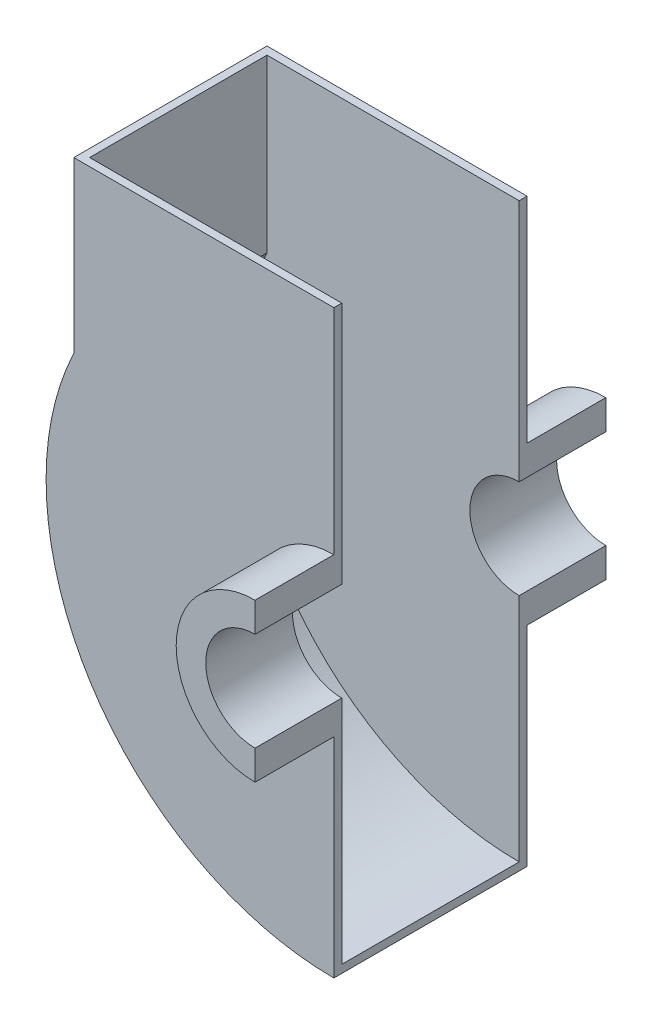
ISO-10303-21;
HEADER;
FILE_DESCRIPTION(('STEP AP214'),'2;1');
FILE_NAME('part.step','',(''),(''),'','','');
FILE_SCHEMA(('AUTOMOTIVE_DESIGN { 1 0 10303 214 1 1 1 1 }'));
ENDSEC;
DATA;
#1=APPLICATION_CONTEXT('core data for automotive mechanical design processes');
#2=APPLICATION_PROTOCOL_DEFINITION('international standard','automotive_design',2000,#1);
#3=PRODUCT_CONTEXT('',#1,'mechanical');
#4=PRODUCT('Part','Part','',(#3));
#5=PRODUCT_RELATED_PRODUCT_CATEGORY('part','',(#4));
#6=PRODUCT_DEFINITION_FORMATION('','',#4);
#7=PRODUCT_DEFINITION_CONTEXT('part definition',#1,'design');
#8=PRODUCT_DEFINITION('design','',#6,#7);
#9=PRODUCT_DEFINITION_SHAPE('','',#8);
#10=(LENGTH_UNIT() NAMED_UNIT(*) SI_UNIT(.MILLI.,.METRE.));
#11=(NAMED_UNIT(*) PLANE_ANGLE_UNIT() SI_UNIT($,.RADIAN.));
#12=(NAMED_UNIT(*) SI_UNIT($,.STERADIAN.) SOLID_ANGLE_UNIT());
#13=UNCERTAINTY_MEASURE_WITH_UNIT(LENGTH_MEASURE(1.E-05),#10,'distance_accuracy_value','');
#14=(GEOMETRIC_REPRESENTATION_CONTEXT(3) GLOBAL_UNCERTAINTY_ASSIGNED_CONTEXT((#13)) GLOBAL_UNIT_ASSIGNED_CONTEXT((#10,
#11,#12)) REPRESENTATION_CONTEXT('',''));
#15=CARTESIAN_POINT('',(0.,0.,0.));
#16=DIRECTION('',(0.,0.,1.));
#17=DIRECTION('',(1.,0.,0.));
#18=AXIS2_PLACEMENT_3D('',#15,#16,#17);
#19=CARTESIAN_POINT('',(65.97,-86.7563449558645,24.5));
#20=DIRECTION('',(-1.,0.,0.));
#21=DIRECTION('',(0.,0.,1.));
#22=AXIS2_PLACEMENT_3D('',#19,#20,#21);
#23=PLANE('',#22);
#24=DIRECTION('',(0.,1.,0.));
#25=VECTOR('',#24,1.);
#26=CARTESIAN_POINT('',(65.97,-74.2563449558645,-22.5));
#27=LINE('',#26,#25);
#28=CARTESIAN_POINT('',(65.97,-145.256344955865,-22.5));
#29=VERTEX_POINT('',#28);
#30=CARTESIAN_POINT('',(65.97,-86.7563449558645,-22.5));
#31=VERTEX_POINT('',#30);
#32=EDGE_CURVE('E210',#29,#31,#27,.T.);
#33=ORIENTED_EDGE('',*,*,#32,.F.);
#34=DIRECTION('',(0.,0.,-1.));
#35=VECTOR('',#34,1.);
#36=CARTESIAN_POINT('',(65.97,-145.256344955865,22.5));
#37=LINE('',#36,#35);
#38=CARTESIAN_POINT('',(65.97,-145.256344955865,22.5));
#39=VERTEX_POINT('',#38);
#40=EDGE_CURVE('E203',#39,#29,#37,.T.);
#41=ORIENTED_EDGE('',*,*,#40,.F.);
#42=DIRECTION('',(0.,1.,0.));
#43=VECTOR('',#42,1.);
#44=CARTESIAN_POINT('',(65.97,-74.2563449558645,22.5));
#45=LINE('',#44,#43);
#46=CARTESIAN_POINT('',(65.97,-86.7563449558645,22.5));
#47=VERTEX_POINT('',#46);
#48=EDGE_CURVE('E212',#39,#47,#45,.T.);
#49=ORIENTED_EDGE('',*,*,#48,.T.);
#50=DIRECTION('',(0.,0.,-1.));
#51=VECTOR('',#50,1.);
#52=CARTESIAN_POINT('',(65.97,-86.7563449558645,24.5));
#53=LINE('',#52,#51);
#54=CARTESIAN_POINT('',(65.97,-86.7563449558645,44.5));
#55=VERTEX_POINT('',#54);
#56=EDGE_CURVE('E268',#55,#47,#53,.T.);
#57=ORIENTED_EDGE('',*,*,#56,.F.);
#58=DIRECTION('',(0.,1.,0.));
#59=VECTOR('',#58,1.);
#60=CARTESIAN_POINT('',(65.97,-86.7563449558645,44.5));
#61=LINE('',#60,#59);
#62=CARTESIAN_POINT('',(65.97,-94.2563449558645,44.5));
#63=VERTEX_POINT('',#62);
#64=EDGE_CURVE('E180',#63,#55,#61,.T.);
#65=ORIENTED_EDGE('',*,*,#64,.F.);
#66=DIRECTION('',(0.,0.,-1.));
#67=VECTOR('',#66,1.);
#68=CARTESIAN_POINT('',(65.97,-94.2563449558645,44.5));
#69=LINE('',#68,#67);
#70=CARTESIAN_POINT('',(65.97,-94.2563449558645,24.5));
#71=VERTEX_POINT('',#70);
#72=EDGE_CURVE('E192',#63,#71,#69,.T.);
#73=ORIENTED_EDGE('',*,*,#72,.T.);
#74=DIRECTION('',(0.,1.,0.));
#75=VECTOR('',#74,1.);
#76=CARTESIAN_POINT('',(65.97,-86.7563449558645,24.5));
#77=LINE('',#76,#75);
#78=CARTESIAN_POINT('',(65.97,-147.256344955864,24.5));
#79=VERTEX_POINT('',#78);
#80=EDGE_CURVE('E241',#79,#71,#77,.T.);
#81=ORIENTED_EDGE('',*,*,#80,.F.);
#82=DIRECTION('',(0.,0.,-1.));
#83=VECTOR('',#82,1.);
#84=CARTESIAN_POINT('',(65.97,-147.256344955864,24.5));
#85=LINE('',#84,#83);
#86=CARTESIAN_POINT('',(65.97,-147.256344955864,-24.5));
#87=VERTEX_POINT('',#86);
#88=EDGE_CURVE('E44',#79,#87,#85,.T.);
#89=ORIENTED_EDGE('',*,*,#88,.T.);
#90=DIRECTION('',(0.,1.,0.));
#91=VECTOR('',#90,1.);
#92=CARTESIAN_POINT('',(65.97,-86.7563449558645,-24.5));
#93=LINE('',#92,#91);
#94=CARTESIAN_POINT('',(65.97,-94.2563449558645,-24.5));
#95=VERTEX_POINT('',#94);
#96=EDGE_CURVE('E252',#87,#95,#93,.T.);
#97=ORIENTED_EDGE('',*,*,#96,.T.);
#98=DIRECTION('',(0.,0.,1.));
#99=VECTOR('',#98,1.);
#100=CARTESIAN_POINT('',(65.97,-94.2563449558645,-44.5));
#101=LINE('',#100,#99);
#102=CARTESIAN_POINT('',(65.97,-94.2563449558645,-44.5));
#103=VERTEX_POINT('',#102);
#104=EDGE_CURVE('E51',#103,#95,#101,.T.);
#105=ORIENTED_EDGE('',*,*,#104,.F.);
#106=DIRECTION('',(0.,1.,0.));
#107=VECTOR('',#106,1.);
#108=CARTESIAN_POINT('',(65.97,-86.7563449558645,-44.5));
#109=LINE('',#108,#107);
#110=CARTESIAN_POINT('',(65.97,-86.7563449558645,-44.5));
#111=VERTEX_POINT('',#110);
#112=EDGE_CURVE('E164',#103,#111,#109,.T.);
#113=ORIENTED_EDGE('',*,*,#112,.T.);
#114=EDGE_CURVE('E267',#31,#111,#53,.T.);
#115=ORIENTED_EDGE('',*,*,#114,.F.);
#116=EDGE_LOOP('',(#33,#41,#49,#57,#65,#73,#81,#89,#97,#105,#113,#115));
#117=FACE_BOUND('',#116,.T.);
#118=ADVANCED_FACE('F36',(#117),#23,.F.);
#119=CARTESIAN_POINT('',(65.97,-74.2563449558645,24.5));
#120=DIRECTION('',(0.,0.,-1.));
#121=DIRECTION('',(-1.,0.,0.));
#122=AXIS2_PLACEMENT_3D('',#119,#120,#121);
#123=CYLINDRICAL_SURFACE('',#122,12.5);
#124=CARTESIAN_POINT('',(65.97,-74.2563449558645,-22.5));
#125=DIRECTION('',(0.,0.,-1.));
#126=DIRECTION('',(-1.,0.,0.));
#127=AXIS2_PLACEMENT_3D('',#124,#125,#126);
#128=CIRCLE('',#127,12.5);
#129=CARTESIAN_POINT('',(65.97,-61.7563449558645,-22.5));
#130=VERTEX_POINT('',#129);
#131=EDGE_CURVE('E230',#31,#130,#128,.T.);
#132=ORIENTED_EDGE('',*,*,#131,.F.);
#133=ORIENTED_EDGE('',*,*,#114,.T.);
#134=CARTESIAN_POINT('',(65.97,-74.2563449558645,-44.5));
#135=DIRECTION('',(0.,0.,-1.));
#136=DIRECTION('',(1.,0.,0.));
#137=AXIS2_PLACEMENT_3D('',#134,#135,#136);
#138=CIRCLE('',#137,12.5);
#139=CARTESIAN_POINT('',(65.97,-61.7563449558645,-44.5));
#140=VERTEX_POINT('',#139);
#141=EDGE_CURVE('E170',#111,#140,#138,.T.);
#142=ORIENTED_EDGE('',*,*,#141,.T.);
#143=DIRECTION('',(0.,0.,-1.));
#144=VECTOR('',#143,1.);
#145=CARTESIAN_POINT('',(65.97,-61.7563449558645,24.5));
#146=LINE('',#145,#144);
#147=EDGE_CURVE('E169',#130,#140,#146,.T.);
#148=ORIENTED_EDGE('',*,*,#147,.F.);
#149=EDGE_LOOP('',(#132,#133,#142,#148));
#150=FACE_BOUND('',#149,.T.);
#151=ADVANCED_FACE('F301',(#150),#123,.F.);
#152=CARTESIAN_POINT('',(65.97,0.,24.5));
#153=DIRECTION('',(-1.,0.,0.));
#154=DIRECTION('',(0.,-1.,0.));
#155=AXIS2_PLACEMENT_3D('',#152,#153,#154);
#156=PLANE('',#155);
#157=DIRECTION('',(0.,1.,0.));
#158=VECTOR('',#157,1.);
#159=CARTESIAN_POINT('',(65.97,-74.2563449558645,-22.5));
#160=LINE('',#159,#158);
#161=CARTESIAN_POINT('',(65.97,0.,-22.5));
#162=VERTEX_POINT('',#161);
#163=EDGE_CURVE('E232',#130,#162,#160,.T.);
#164=ORIENTED_EDGE('',*,*,#163,.F.);
#165=ORIENTED_EDGE('',*,*,#147,.T.);
#166=DIRECTION('',(0.,1.,0.));
#167=VECTOR('',#166,1.);
#168=CARTESIAN_POINT('',(65.97,-54.2563449558645,-44.5));
#169=LINE('',#168,#167);
#170=CARTESIAN_POINT('',(65.97,-54.2563449558645,-44.5));
#171=VERTEX_POINT('',#170);
#172=EDGE_CURVE('E161',#140,#171,#169,.T.);
#173=ORIENTED_EDGE('',*,*,#172,.T.);
#174=DIRECTION('',(0.,0.,1.));
#175=VECTOR('',#174,1.);
#176=CARTESIAN_POINT('',(65.97,-54.2563449558645,-44.5));
#177=LINE('',#176,#175);
#178=CARTESIAN_POINT('',(65.97,-54.2563449558645,-24.5));
#179=VERTEX_POINT('',#178);
#180=EDGE_CURVE('E147',#171,#179,#177,.T.);
#181=ORIENTED_EDGE('',*,*,#180,.T.);
#182=DIRECTION('',(0.,1.,0.));
#183=VECTOR('',#182,1.);
#184=CARTESIAN_POINT('',(65.97,0.,-24.5));
#185=LINE('',#184,#183);
#186=CARTESIAN_POINT('',(65.97,0.,-24.5));
#187=VERTEX_POINT('',#186);
#188=EDGE_CURVE('E255',#179,#187,#185,.T.);
#189=ORIENTED_EDGE('',*,*,#188,.T.);
#190=DIRECTION('',(0.,0.,-1.));
#191=VECTOR('',#190,1.);
#192=CARTESIAN_POINT('',(65.97,0.,24.5));
#193=LINE('',#192,#191);
#194=EDGE_CURVE('E260',#162,#187,#193,.T.);
#195=ORIENTED_EDGE('',*,*,#194,.F.);
#196=EDGE_LOOP('',(#164,#165,#173,#181,#189,#195));
#197=FACE_BOUND('',#196,.T.);
#198=ADVANCED_FACE('F167',(#197),#156,.F.);
#199=CARTESIAN_POINT('',(0.,0.,24.5));
#200=DIRECTION('',(0.,-1.,0.));
#201=DIRECTION('',(0.,0.,-1.));
#202=AXIS2_PLACEMENT_3D('',#199,#200,#201);
#203=PLANE('',#202);
#204=DIRECTION('',(-1.,0.,0.));
#205=VECTOR('',#204,1.);
#206=CARTESIAN_POINT('',(65.97,0.,-22.5));
#207=LINE('',#206,#205);
#208=CARTESIAN_POINT('',(2.,0.,-22.5));
#209=VERTEX_POINT('',#208);
#210=EDGE_CURVE('E208',#162,#209,#207,.T.);
#211=ORIENTED_EDGE('',*,*,#210,.F.);
#212=ORIENTED_EDGE('',*,*,#194,.T.);
#213=DIRECTION('',(-1.,0.,0.));
#214=VECTOR('',#213,1.);
#215=CARTESIAN_POINT('',(0.,0.,-24.5));
#216=LINE('',#215,#214);
#217=CARTESIAN_POINT('',(0.,0.,-24.5));
#218=VERTEX_POINT('',#217);
#219=EDGE_CURVE('E239',#187,#218,#216,.T.);
#220=ORIENTED_EDGE('',*,*,#219,.T.);
#221=DIRECTION('',(0.,0.,-1.));
#222=VECTOR('',#221,1.);
#223=CARTESIAN_POINT('',(0.,0.,24.5));
#224=LINE('',#223,#222);
#225=CARTESIAN_POINT('',(0.,0.,24.5));
#226=VERTEX_POINT('',#225);
#227=EDGE_CURVE('E247',#226,#218,#224,.T.);
#228=ORIENTED_EDGE('',*,*,#227,.F.);
#229=DIRECTION('',(-1.,0.,0.));
#230=VECTOR('',#229,1.);
#231=CARTESIAN_POINT('',(0.,0.,24.5));
#232=LINE('',#231,#230);
#233=CARTESIAN_POINT('',(65.97,0.,24.5));
#234=VERTEX_POINT('',#233);
#235=EDGE_CURVE('E245',#234,#226,#232,.T.);
#236=ORIENTED_EDGE('',*,*,#235,.F.);
#237=CARTESIAN_POINT('',(65.97,0.,22.5));
#238=VERTEX_POINT('',#237);
#239=EDGE_CURVE('E261',#234,#238,#193,.T.);
#240=ORIENTED_EDGE('',*,*,#239,.T.);
#241=DIRECTION('',(-1.,0.,0.));
#242=VECTOR('',#241,1.);
#243=CARTESIAN_POINT('',(65.97,0.,22.5));
#244=LINE('',#243,#242);
#245=CARTESIAN_POINT('',(2.,0.,22.5));
#246=VERTEX_POINT('',#245);
#247=EDGE_CURVE('E216',#238,#246,#244,.T.);
#248=ORIENTED_EDGE('',*,*,#247,.T.);
#249=DIRECTION('',(0.,0.,-1.));
#250=VECTOR('',#249,1.);
#251=CARTESIAN_POINT('',(2.,0.,24.5));
#252=LINE('',#251,#250);
#253=EDGE_CURVE('E213',#246,#209,#252,.T.);
#254=ORIENTED_EDGE('',*,*,#253,.T.);
#255=EDGE_LOOP('',(#211,#212,#220,#228,#236,#240,#248,#254));
#256=FACE_BOUND('',#255,.T.);
#257=ADVANCED_FACE('F285',(#256),#203,.F.);
#258=CARTESIAN_POINT('',(0.,0.,24.5));
#259=DIRECTION('',(1.,0.,0.));
#260=DIRECTION('',(0.,1.,0.));
#261=AXIS2_PLACEMENT_3D('',#258,#259,#260);
#262=PLANE('',#261);
#263=DIRECTION('',(0.,-1.,0.));
#264=VECTOR('',#263,1.);
#265=CARTESIAN_POINT('',(0.,0.,-24.5));
#266=LINE('',#265,#264);
#267=CARTESIAN_POINT('',(0.,-43.,-24.5));
#268=VERTEX_POINT('',#267);
#269=EDGE_CURVE('E202',#218,#268,#266,.T.);
#270=ORIENTED_EDGE('',*,*,#269,.T.);
#271=DIRECTION('',(0.,0.,-1.));
#272=VECTOR('',#271,1.);
#273=CARTESIAN_POINT('',(0.,-43.,24.5));
#274=LINE('',#273,#272);
#275=CARTESIAN_POINT('',(0.,-43.,24.5));
#276=VERTEX_POINT('',#275);
#277=EDGE_CURVE('E11',#276,#268,#274,.T.);
#278=ORIENTED_EDGE('',*,*,#277,.F.);
#279=DIRECTION('',(0.,-1.,0.));
#280=VECTOR('',#279,1.);
#281=CARTESIAN_POINT('',(0.,0.,24.5));
#282=LINE('',#281,#280);
#283=EDGE_CURVE('E235',#226,#276,#282,.T.);
#284=ORIENTED_EDGE('',*,*,#283,.F.);
#285=ORIENTED_EDGE('',*,*,#227,.T.);
#286=EDGE_LOOP('',(#270,#278,#284,#285));
#287=FACE_BOUND('',#286,.T.);
#288=ADVANCED_FACE('F38',(#287),#262,.F.);
#289=CARTESIAN_POINT('',(65.97,-74.2563449558645,24.5));
#290=DIRECTION('',(0.,0.,-1.));
#291=DIRECTION('',(-1.,0.,0.));
#292=AXIS2_PLACEMENT_3D('',#289,#290,#291);
#293=CYLINDRICAL_SURFACE('',#292,73.);
#294=CARTESIAN_POINT('',(65.97,-74.2563449558645,-24.5));
#295=DIRECTION('',(0.,0.,1.));
#296=DIRECTION('',(-1.,0.,0.));
#297=AXIS2_PLACEMENT_3D('',#294,#295,#296);
#298=CIRCLE('',#297,73.);
#299=EDGE_CURVE('E250',#268,#87,#298,.T.);
#300=ORIENTED_EDGE('',*,*,#299,.T.);
#301=ORIENTED_EDGE('',*,*,#88,.F.);
#302=CARTESIAN_POINT('',(65.97,-74.2563449558645,24.5));
#303=DIRECTION('',(0.,0.,1.));
#304=DIRECTION('',(-1.,0.,0.));
#305=AXIS2_PLACEMENT_3D('',#302,#303,#304);
#306=CIRCLE('',#305,73.);
#307=EDGE_CURVE('E238',#276,#79,#306,.T.);
#308=ORIENTED_EDGE('',*,*,#307,.F.);
#309=ORIENTED_EDGE('',*,*,#277,.T.);
#310=EDGE_LOOP('',(#300,#301,#308,#309));
#311=FACE_BOUND('',#310,.T.);
#312=ADVANCED_FACE('F313',(#311),#293,.T.);
#313=ORIENTED_EDGE('',*,*,#56,.T.);
#314=CARTESIAN_POINT('',(65.97,-74.2563449558645,22.5));
#315=DIRECTION('',(0.,0.,-1.));
#316=DIRECTION('',(-1.,0.,0.));
#317=AXIS2_PLACEMENT_3D('',#314,#315,#316);
#318=CIRCLE('',#317,12.5);
#319=CARTESIAN_POINT('',(65.97,-61.7563449558645,22.5));
#320=VERTEX_POINT('',#319);
#321=EDGE_CURVE('E222',#47,#320,#318,.T.);
#322=ORIENTED_EDGE('',*,*,#321,.T.);
#323=CARTESIAN_POINT('',(65.97,-61.7563449558645,44.5));
#324=VERTEX_POINT('',#323);
#325=EDGE_CURVE('E264',#324,#320,#146,.T.);
#326=ORIENTED_EDGE('',*,*,#325,.F.);
#327=CARTESIAN_POINT('',(65.97,-74.2563449558645,44.5));
#328=DIRECTION('',(0.,0.,-1.));
#329=DIRECTION('',(1.,0.,0.));
#330=AXIS2_PLACEMENT_3D('',#327,#328,#329);
#331=CIRCLE('',#330,12.5);
#332=EDGE_CURVE('E183',#55,#324,#331,.T.);
#333=ORIENTED_EDGE('',*,*,#332,.F.);
#334=EDGE_LOOP('',(#313,#322,#326,#333));
#335=FACE_BOUND('',#334,.T.);
#336=ADVANCED_FACE('F304',(#335),#123,.F.);
#337=ORIENTED_EDGE('',*,*,#325,.T.);
#338=DIRECTION('',(0.,1.,0.));
#339=VECTOR('',#338,1.);
#340=CARTESIAN_POINT('',(65.97,-74.2563449558645,22.5));
#341=LINE('',#340,#339);
#342=EDGE_CURVE('E219',#320,#238,#341,.T.);
#343=ORIENTED_EDGE('',*,*,#342,.T.);
#344=ORIENTED_EDGE('',*,*,#239,.F.);
#345=DIRECTION('',(0.,1.,0.));
#346=VECTOR('',#345,1.);
#347=CARTESIAN_POINT('',(65.97,0.,24.5));
#348=LINE('',#347,#346);
#349=CARTESIAN_POINT('',(65.97,-54.2563449558645,24.5));
#350=VERTEX_POINT('',#349);
#351=EDGE_CURVE('E243',#350,#234,#348,.T.);
#352=ORIENTED_EDGE('',*,*,#351,.F.);
#353=DIRECTION('',(0.,0.,-1.));
#354=VECTOR('',#353,1.);
#355=CARTESIAN_POINT('',(65.97,-54.2563449558645,44.5));
#356=LINE('',#355,#354);
#357=CARTESIAN_POINT('',(65.97,-54.2563449558645,44.5));
#358=VERTEX_POINT('',#357);
#359=EDGE_CURVE('E188',#358,#350,#356,.T.);
#360=ORIENTED_EDGE('',*,*,#359,.F.);
#361=DIRECTION('',(0.,1.,0.));
#362=VECTOR('',#361,1.);
#363=CARTESIAN_POINT('',(65.97,-54.2563449558645,44.5));
#364=LINE('',#363,#362);
#365=EDGE_CURVE('E186',#324,#358,#364,.T.);
#366=ORIENTED_EDGE('',*,*,#365,.F.);
#367=EDGE_LOOP('',(#337,#343,#344,#352,#360,#366));
#368=FACE_BOUND('',#367,.T.);
#369=ADVANCED_FACE('F310',(#368),#156,.F.);
#370=CARTESIAN_POINT('',(65.97,-74.2563449558645,24.5));
#371=DIRECTION('',(0.,0.,-1.));
#372=DIRECTION('',(-1.,0.,0.));
#373=AXIS2_PLACEMENT_3D('',#370,#371,#372);
#374=PLANE('',#373);
#375=CARTESIAN_POINT('',(65.97,-74.2563449558645,24.5));
#376=DIRECTION('',(0.,0.,1.));
#377=DIRECTION('',(1.,0.,0.));
#378=AXIS2_PLACEMENT_3D('',#375,#376,#377);
#379=CIRCLE('',#378,20.);
#380=EDGE_CURVE('E59',#350,#71,#379,.T.);
#381=ORIENTED_EDGE('',*,*,#380,.F.);
#382=ORIENTED_EDGE('',*,*,#351,.T.);
#383=ORIENTED_EDGE('',*,*,#235,.T.);
#384=ORIENTED_EDGE('',*,*,#283,.T.);
#385=ORIENTED_EDGE('',*,*,#307,.T.);
#386=ORIENTED_EDGE('',*,*,#80,.T.);
#387=EDGE_LOOP('',(#381,#382,#383,#384,#385,#386));
#388=FACE_BOUND('',#387,.T.);
#389=ADVANCED_FACE('F319',(#388),#374,.F.);
#390=CARTESIAN_POINT('',(65.97,-74.2563449558645,-24.5));
#391=DIRECTION('',(0.,0.,-1.));
#392=DIRECTION('',(-1.,0.,0.));
#393=AXIS2_PLACEMENT_3D('',#390,#391,#392);
#394=PLANE('',#393);
#395=ORIENTED_EDGE('',*,*,#188,.F.);
#396=CARTESIAN_POINT('',(65.97,-74.2563449558645,-24.5));
#397=DIRECTION('',(0.,0.,1.));
#398=DIRECTION('',(1.,0.,0.));
#399=AXIS2_PLACEMENT_3D('',#396,#397,#398);
#400=CIRCLE('',#399,20.);
#401=EDGE_CURVE('E152',#179,#95,#400,.T.);
#402=ORIENTED_EDGE('',*,*,#401,.T.);
#403=ORIENTED_EDGE('',*,*,#96,.F.);
#404=ORIENTED_EDGE('',*,*,#299,.F.);
#405=ORIENTED_EDGE('',*,*,#269,.F.);
#406=ORIENTED_EDGE('',*,*,#219,.F.);
#407=EDGE_LOOP('',(#395,#402,#403,#404,#405,#406));
#408=FACE_BOUND('',#407,.T.);
#409=ADVANCED_FACE('F278',(#408),#394,.T.);
#410=CARTESIAN_POINT('',(2.,0.,24.5));
#411=DIRECTION('',(1.,0.,0.));
#412=DIRECTION('',(0.,1.,0.));
#413=AXIS2_PLACEMENT_3D('',#410,#411,#412);
#414=PLANE('',#413);
#415=DIRECTION('',(0.,-1.,0.));
#416=VECTOR('',#415,1.);
#417=CARTESIAN_POINT('',(2.00000000000002,-74.2563449558645,-22.5));
#418=LINE('',#417,#416);
#419=CARTESIAN_POINT('',(2.00000000000001,-43.4531129825797,-22.5));
#420=VERTEX_POINT('',#419);
#421=EDGE_CURVE('E195',#209,#420,#418,.T.);
#422=ORIENTED_EDGE('',*,*,#421,.F.);
#423=ORIENTED_EDGE('',*,*,#253,.F.);
#424=DIRECTION('',(0.,-1.,0.));
#425=VECTOR('',#424,1.);
#426=CARTESIAN_POINT('',(2.00000000000002,-74.2563449558645,22.5));
#427=LINE('',#426,#425);
#428=CARTESIAN_POINT('',(2.00000000000001,-43.4531129825797,22.5));
#429=VERTEX_POINT('',#428);
#430=EDGE_CURVE('E204',#246,#429,#427,.T.);
#431=ORIENTED_EDGE('',*,*,#430,.T.);
#432=DIRECTION('',(0.,0.,-1.));
#433=VECTOR('',#432,1.);
#434=CARTESIAN_POINT('',(2.00000000000001,-43.4531129825797,22.5));
#435=LINE('',#434,#433);
#436=EDGE_CURVE('E199',#429,#420,#435,.T.);
#437=ORIENTED_EDGE('',*,*,#436,.T.);
#438=EDGE_LOOP('',(#422,#423,#431,#437));
#439=FACE_BOUND('',#438,.T.);
#440=ADVANCED_FACE('F292',(#439),#414,.T.);
#441=CARTESIAN_POINT('',(65.97,-74.2563449558645,24.5));
#442=DIRECTION('',(0.,0.,-1.));
#443=DIRECTION('',(-1.,0.,0.));
#444=AXIS2_PLACEMENT_3D('',#441,#442,#443);
#445=CYLINDRICAL_SURFACE('',#444,71.);
#446=CARTESIAN_POINT('',(65.97,-74.2563449558645,-22.5));
#447=DIRECTION('',(0.,0.,-1.));
#448=DIRECTION('',(-1.,0.,0.));
#449=AXIS2_PLACEMENT_3D('',#446,#447,#448);
#450=CIRCLE('',#449,71.);
#451=EDGE_CURVE('E198',#420,#29,#450,.F.);
#452=ORIENTED_EDGE('',*,*,#451,.F.);
#453=ORIENTED_EDGE('',*,*,#436,.F.);
#454=CARTESIAN_POINT('',(65.97,-74.2563449558645,22.5));
#455=DIRECTION('',(0.,0.,-1.));
#456=DIRECTION('',(-1.,0.,0.));
#457=AXIS2_PLACEMENT_3D('',#454,#455,#456);
#458=CIRCLE('',#457,71.);
#459=EDGE_CURVE('E207',#429,#39,#458,.F.);
#460=ORIENTED_EDGE('',*,*,#459,.T.);
#461=ORIENTED_EDGE('',*,*,#40,.T.);
#462=EDGE_LOOP('',(#452,#453,#460,#461));
#463=FACE_BOUND('',#462,.T.);
#464=ADVANCED_FACE('F295',(#463),#445,.F.);
#465=CARTESIAN_POINT('',(65.97,-74.2563449558645,22.5));
#466=DIRECTION('',(0.,0.,-1.));
#467=DIRECTION('',(-1.,0.,0.));
#468=AXIS2_PLACEMENT_3D('',#465,#466,#467);
#469=PLANE('',#468);
#470=ORIENTED_EDGE('',*,*,#430,.F.);
#471=ORIENTED_EDGE('',*,*,#247,.F.);
#472=ORIENTED_EDGE('',*,*,#342,.F.);
#473=ORIENTED_EDGE('',*,*,#321,.F.);
#474=ORIENTED_EDGE('',*,*,#48,.F.);
#475=ORIENTED_EDGE('',*,*,#459,.F.);
#476=EDGE_LOOP('',(#470,#471,#472,#473,#474,#475));
#477=FACE_BOUND('',#476,.T.);
#478=ADVANCED_FACE('F349',(#477),#469,.T.);
#479=CARTESIAN_POINT('',(65.97,-74.2563449558645,-22.5));
#480=DIRECTION('',(0.,0.,-1.));
#481=DIRECTION('',(-1.,0.,0.));
#482=AXIS2_PLACEMENT_3D('',#479,#480,#481);
#483=PLANE('',#482);
#484=ORIENTED_EDGE('',*,*,#421,.T.);
#485=ORIENTED_EDGE('',*,*,#451,.T.);
#486=ORIENTED_EDGE('',*,*,#32,.T.);
#487=ORIENTED_EDGE('',*,*,#131,.T.);
#488=ORIENTED_EDGE('',*,*,#163,.T.);
#489=ORIENTED_EDGE('',*,*,#210,.T.);
#490=EDGE_LOOP('',(#484,#485,#486,#487,#488,#489));
#491=FACE_BOUND('',#490,.T.);
#492=ADVANCED_FACE('F290',(#491),#483,.F.);
#493=CARTESIAN_POINT('',(65.97,-74.2563449558645,44.5));
#494=DIRECTION('',(0.,0.,-1.));
#495=DIRECTION('',(-1.,0.,0.));
#496=AXIS2_PLACEMENT_3D('',#493,#494,#495);
#497=CYLINDRICAL_SURFACE('',#496,20.);
#498=ORIENTED_EDGE('',*,*,#380,.T.);
#499=ORIENTED_EDGE('',*,*,#72,.F.);
#500=CARTESIAN_POINT('',(65.97,-74.2563449558645,44.5));
#501=DIRECTION('',(0.,0.,1.));
#502=DIRECTION('',(1.,0.,0.));
#503=AXIS2_PLACEMENT_3D('',#500,#501,#502);
#504=CIRCLE('',#503,20.);
#505=EDGE_CURVE('E177',#358,#63,#504,.T.);
#506=ORIENTED_EDGE('',*,*,#505,.F.);
#507=ORIENTED_EDGE('',*,*,#359,.T.);
#508=EDGE_LOOP('',(#498,#499,#506,#507));
#509=FACE_BOUND('',#508,.T.);
#510=ADVANCED_FACE('F329',(#509),#497,.T.);
#511=CARTESIAN_POINT('',(65.97,-74.2563449558645,44.5));
#512=DIRECTION('',(0.,0.,1.));
#513=DIRECTION('',(1.,0.,0.));
#514=AXIS2_PLACEMENT_3D('',#511,#512,#513);
#515=PLANE('',#514);
#516=ORIENTED_EDGE('',*,*,#505,.T.);
#517=ORIENTED_EDGE('',*,*,#64,.T.);
#518=ORIENTED_EDGE('',*,*,#332,.T.);
#519=ORIENTED_EDGE('',*,*,#365,.T.);
#520=EDGE_LOOP('',(#516,#517,#518,#519));
#521=FACE_BOUND('',#520,.T.);
#522=ADVANCED_FACE('F323',(#521),#515,.T.);
#523=CARTESIAN_POINT('',(65.97,-74.2563449558645,-44.5));
#524=DIRECTION('',(0.,0.,1.));
#525=DIRECTION('',(1.,0.,0.));
#526=AXIS2_PLACEMENT_3D('',#523,#524,#525);
#527=CYLINDRICAL_SURFACE('',#526,20.);
#528=ORIENTED_EDGE('',*,*,#401,.F.);
#529=ORIENTED_EDGE('',*,*,#180,.F.);
#530=CARTESIAN_POINT('',(65.97,-74.2563449558645,-44.5));
#531=DIRECTION('',(0.,0.,1.));
#532=DIRECTION('',(1.,0.,0.));
#533=AXIS2_PLACEMENT_3D('',#530,#531,#532);
#534=CIRCLE('',#533,20.);
#535=EDGE_CURVE('E150',#171,#103,#534,.T.);
#536=ORIENTED_EDGE('',*,*,#535,.T.);
#537=ORIENTED_EDGE('',*,*,#104,.T.);
#538=EDGE_LOOP('',(#528,#529,#536,#537));
#539=FACE_BOUND('',#538,.T.);
#540=ADVANCED_FACE('F149',(#539),#527,.T.);
#541=CARTESIAN_POINT('',(65.97,-74.2563449558645,-44.5));
#542=DIRECTION('',(0.,0.,-1.));
#543=DIRECTION('',(1.,0.,0.));
#544=AXIS2_PLACEMENT_3D('',#541,#542,#543);
#545=PLANE('',#544);
#546=ORIENTED_EDGE('',*,*,#535,.F.);
#547=ORIENTED_EDGE('',*,*,#172,.F.);
#548=ORIENTED_EDGE('',*,*,#141,.F.);
#549=ORIENTED_EDGE('',*,*,#112,.F.);
#550=EDGE_LOOP('',(#546,#547,#548,#549));
#551=FACE_BOUND('',#550,.T.);
#552=ADVANCED_FACE('F159',(#551),#545,.T.);
#553=CLOSED_SHELL('',(#118,#151,#198,#257,#288,#312,#336,#369,#389,#409,#440,#464,#478,#492,
#510,#522,#540,#552));
#554=MANIFOLD_SOLID_BREP('B2',#553);
#555=ADVANCED_BREP_SHAPE_REPRESENTATION('',(#18,#554),#14);
#556=SHAPE_DEFINITION_REPRESENTATION(#9,#555);
ENDSEC;
END-ISO-10303-21;
